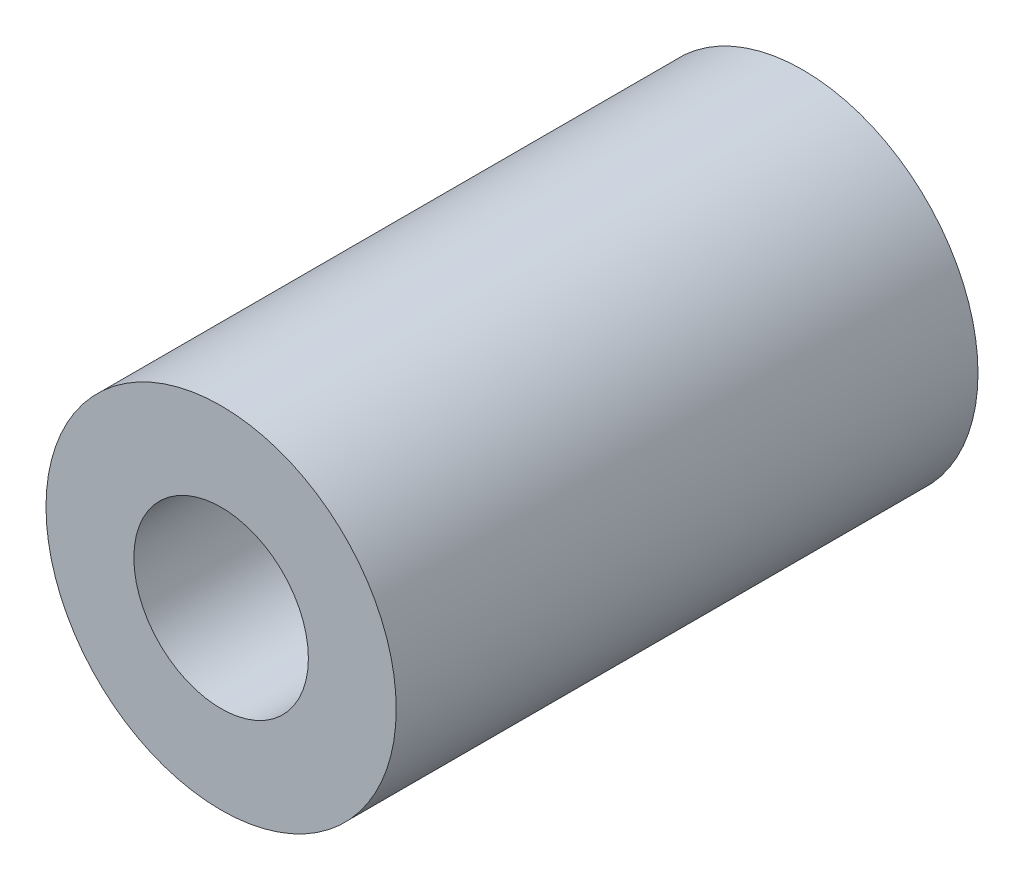
ISO-10303-21;
HEADER;
FILE_DESCRIPTION(('STEP AP214'),'2;1');
FILE_NAME('part.step','',(''),(''),'','','');
FILE_SCHEMA(('AUTOMOTIVE_DESIGN { 1 0 10303 214 1 1 1 1 }'));
ENDSEC;
DATA;
#1=APPLICATION_CONTEXT('core data for automotive mechanical design processes');
#2=APPLICATION_PROTOCOL_DEFINITION('international standard','automotive_design',2000,#1);
#3=PRODUCT_CONTEXT('',#1,'mechanical');
#4=PRODUCT('Part','Part','',(#3));
#5=PRODUCT_RELATED_PRODUCT_CATEGORY('part','',(#4));
#6=PRODUCT_DEFINITION_FORMATION('','',#4);
#7=PRODUCT_DEFINITION_CONTEXT('part definition',#1,'design');
#8=PRODUCT_DEFINITION('design','',#6,#7);
#9=PRODUCT_DEFINITION_SHAPE('','',#8);
#10=(LENGTH_UNIT() NAMED_UNIT(*) SI_UNIT(.MILLI.,.METRE.));
#11=(NAMED_UNIT(*) PLANE_ANGLE_UNIT() SI_UNIT($,.RADIAN.));
#12=(NAMED_UNIT(*) SI_UNIT($,.STERADIAN.) SOLID_ANGLE_UNIT());
#13=UNCERTAINTY_MEASURE_WITH_UNIT(LENGTH_MEASURE(1.E-05),#10,'distance_accuracy_value','');
#14=(GEOMETRIC_REPRESENTATION_CONTEXT(3) GLOBAL_UNCERTAINTY_ASSIGNED_CONTEXT((#13)) GLOBAL_UNIT_ASSIGNED_CONTEXT((#10,
#11,#12)) REPRESENTATION_CONTEXT('',''));
#15=CARTESIAN_POINT('',(0.,0.,0.));
#16=DIRECTION('',(0.,0.,1.));
#17=DIRECTION('',(1.,0.,0.));
#18=AXIS2_PLACEMENT_3D('',#15,#16,#17);
#19=CARTESIAN_POINT('',(0.,0.,5.));
#20=DIRECTION('',(0.,0.,1.));
#21=DIRECTION('',(1.,0.,0.));
#22=AXIS2_PLACEMENT_3D('',#19,#20,#21);
#23=PLANE('',#22);
#24=CARTESIAN_POINT('',(0.,0.,5.));
#25=DIRECTION('',(0.,0.,1.));
#26=DIRECTION('',(1.,0.,0.));
#27=AXIS2_PLACEMENT_3D('',#24,#25,#26);
#28=CIRCLE('',#27,3.01);
#29=CARTESIAN_POINT('',(3.01,0.,5.));
#30=VERTEX_POINT('',#29);
#31=EDGE_CURVE('E10',#30,#30,#28,.T.);
#32=ORIENTED_EDGE('',*,*,#31,.T.);
#33=EDGE_LOOP('',(#32));
#34=FACE_BOUND('',#33,.T.);
#35=CARTESIAN_POINT('',(0.,0.,5.));
#36=DIRECTION('',(0.,0.,1.));
#37=DIRECTION('',(1.,0.,0.));
#38=AXIS2_PLACEMENT_3D('',#35,#36,#37);
#39=CIRCLE('',#38,1.5);
#40=CARTESIAN_POINT('',(1.5,0.,5.));
#41=VERTEX_POINT('',#40);
#42=EDGE_CURVE('E41',#41,#41,#39,.T.);
#43=ORIENTED_EDGE('',*,*,#42,.F.);
#44=EDGE_LOOP('',(#43));
#45=FACE_BOUND('',#44,.T.);
#46=ADVANCED_FACE('F30',(#34,#45),#23,.T.);
#47=CARTESIAN_POINT('',(0.,0.,-5.));
#48=DIRECTION('',(0.,0.,1.));
#49=DIRECTION('',(1.,0.,0.));
#50=AXIS2_PLACEMENT_3D('',#47,#48,#49);
#51=PLANE('',#50);
#52=CARTESIAN_POINT('',(0.,0.,-5.));
#53=DIRECTION('',(0.,0.,1.));
#54=DIRECTION('',(1.,0.,0.));
#55=AXIS2_PLACEMENT_3D('',#52,#53,#54);
#56=CIRCLE('',#55,3.01);
#57=CARTESIAN_POINT('',(3.01,0.,-5.));
#58=VERTEX_POINT('',#57);
#59=EDGE_CURVE('E34',#58,#58,#56,.T.);
#60=ORIENTED_EDGE('',*,*,#59,.F.);
#61=EDGE_LOOP('',(#60));
#62=FACE_BOUND('',#61,.T.);
#63=CARTESIAN_POINT('',(0.,0.,-5.));
#64=DIRECTION('',(0.,0.,1.));
#65=DIRECTION('',(1.,0.,0.));
#66=AXIS2_PLACEMENT_3D('',#63,#64,#65);
#67=CIRCLE('',#66,1.5);
#68=CARTESIAN_POINT('',(1.5,0.,-5.));
#69=VERTEX_POINT('',#68);
#70=EDGE_CURVE('E43',#69,#69,#67,.T.);
#71=ORIENTED_EDGE('',*,*,#70,.T.);
#72=EDGE_LOOP('',(#71));
#73=FACE_BOUND('',#72,.T.);
#74=ADVANCED_FACE('F53',(#62,#73),#51,.F.);
#75=CARTESIAN_POINT('',(0.,0.,5.));
#76=DIRECTION('',(0.,0.,-1.));
#77=DIRECTION('',(-1.,0.,0.));
#78=AXIS2_PLACEMENT_3D('',#75,#76,#77);
#79=CYLINDRICAL_SURFACE('',#78,3.01);
#80=ORIENTED_EDGE('',*,*,#31,.F.);
#81=EDGE_LOOP('',(#80));
#82=FACE_BOUND('',#81,.T.);
#83=ORIENTED_EDGE('',*,*,#59,.T.);
#84=EDGE_LOOP('',(#83));
#85=FACE_BOUND('',#84,.T.);
#86=ADVANCED_FACE('F32',(#82,#85),#79,.T.);
#87=CARTESIAN_POINT('',(0.,0.,5.));
#88=DIRECTION('',(0.,0.,-1.));
#89=DIRECTION('',(-1.,0.,0.));
#90=AXIS2_PLACEMENT_3D('',#87,#88,#89);
#91=CYLINDRICAL_SURFACE('',#90,1.5);
#92=ORIENTED_EDGE('',*,*,#42,.T.);
#93=EDGE_LOOP('',(#92));
#94=FACE_BOUND('',#93,.T.);
#95=ORIENTED_EDGE('',*,*,#70,.F.);
#96=EDGE_LOOP('',(#95));
#97=FACE_BOUND('',#96,.T.);
#98=ADVANCED_FACE('F49',(#94,#97),#91,.F.);
#99=CLOSED_SHELL('',(#46,#74,#86,#98));
#100=MANIFOLD_SOLID_BREP('B2',#99);
#101=ADVANCED_BREP_SHAPE_REPRESENTATION('',(#18,#100),#14);
#102=SHAPE_DEFINITION_REPRESENTATION(#9,#101);
ENDSEC;
END-ISO-10303-21;
